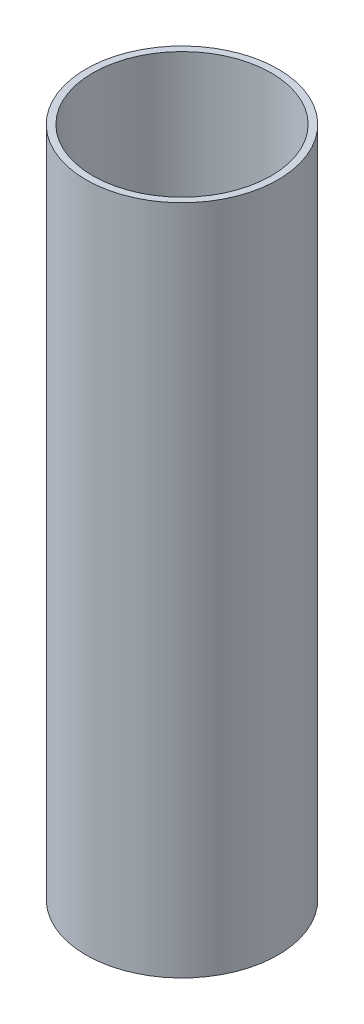
ISO-10303-21;
HEADER;
FILE_DESCRIPTION(('STEP AP214'),'2;1');
FILE_NAME('part.step','',(''),(''),'','','');
FILE_SCHEMA(('AUTOMOTIVE_DESIGN { 1 0 10303 214 1 1 1 1 }'));
ENDSEC;
DATA;
#1=APPLICATION_CONTEXT('core data for automotive mechanical design processes');
#2=APPLICATION_PROTOCOL_DEFINITION('international standard','automotive_design',2000,#1);
#3=PRODUCT_CONTEXT('',#1,'mechanical');
#4=PRODUCT('Part','Part','',(#3));
#5=PRODUCT_RELATED_PRODUCT_CATEGORY('part','',(#4));
#6=PRODUCT_DEFINITION_FORMATION('','',#4);
#7=PRODUCT_DEFINITION_CONTEXT('part definition',#1,'design');
#8=PRODUCT_DEFINITION('design','',#6,#7);
#9=PRODUCT_DEFINITION_SHAPE('','',#8);
#10=(LENGTH_UNIT() NAMED_UNIT(*) SI_UNIT(.MILLI.,.METRE.));
#11=(NAMED_UNIT(*) PLANE_ANGLE_UNIT() SI_UNIT($,.RADIAN.));
#12=(NAMED_UNIT(*) SI_UNIT($,.STERADIAN.) SOLID_ANGLE_UNIT());
#13=UNCERTAINTY_MEASURE_WITH_UNIT(LENGTH_MEASURE(1.E-05),#10,'distance_accuracy_value','');
#14=(GEOMETRIC_REPRESENTATION_CONTEXT(3) GLOBAL_UNCERTAINTY_ASSIGNED_CONTEXT((#13)) GLOBAL_UNIT_ASSIGNED_CONTEXT((#10,
#11,#12)) REPRESENTATION_CONTEXT('',''));
#15=CARTESIAN_POINT('',(0.,0.,0.));
#16=DIRECTION('',(0.,0.,1.));
#17=DIRECTION('',(1.,0.,0.));
#18=AXIS2_PLACEMENT_3D('',#15,#16,#17);
#19=CARTESIAN_POINT('',(0.,-13.97,0.));
#20=DIRECTION('',(0.,-1.,0.));
#21=DIRECTION('',(0.,0.,-1.));
#22=AXIS2_PLACEMENT_3D('',#19,#20,#21);
#23=CYLINDRICAL_SURFACE('',#22,23.622);
#24=CARTESIAN_POINT('',(0.,0.,0.));
#25=DIRECTION('',(0.,-1.,0.));
#26=DIRECTION('',(0.,0.,-1.));
#27=AXIS2_PLACEMENT_3D('',#24,#25,#26);
#28=CIRCLE('',#27,23.622);
#29=CARTESIAN_POINT('',(0.,0.,-23.622));
#30=VERTEX_POINT('',#29);
#31=EDGE_CURVE('E50',#30,#30,#28,.T.);
#32=ORIENTED_EDGE('',*,*,#31,.T.);
#33=EDGE_LOOP('',(#32));
#34=FACE_BOUND('',#33,.T.);
#35=CARTESIAN_POINT('',(0.,177.8,0.));
#36=DIRECTION('',(0.,-1.,0.));
#37=DIRECTION('',(0.,0.,-1.));
#38=AXIS2_PLACEMENT_3D('',#35,#36,#37);
#39=CIRCLE('',#38,23.622);
#40=CARTESIAN_POINT('',(0.,177.8,-23.622));
#41=VERTEX_POINT('',#40);
#42=EDGE_CURVE('E10',#41,#41,#39,.T.);
#43=ORIENTED_EDGE('',*,*,#42,.F.);
#44=EDGE_LOOP('',(#43));
#45=FACE_BOUND('',#44,.T.);
#46=ADVANCED_FACE('F36',(#34,#45),#23,.F.);
#47=CARTESIAN_POINT('',(23.622,177.8,0.));
#48=DIRECTION('',(0.,1.,0.));
#49=DIRECTION('',(0.,0.,1.));
#50=AXIS2_PLACEMENT_3D('',#47,#48,#49);
#51=PLANE('',#50);
#52=ORIENTED_EDGE('',*,*,#42,.T.);
#53=EDGE_LOOP('',(#52));
#54=FACE_BOUND('',#53,.T.);
#55=CARTESIAN_POINT('',(0.,177.8,0.));
#56=DIRECTION('',(0.,-1.,0.));
#57=DIRECTION('',(0.,0.,-1.));
#58=AXIS2_PLACEMENT_3D('',#55,#56,#57);
#59=CIRCLE('',#58,25.4254);
#60=CARTESIAN_POINT('',(0.,177.8,-25.4254));
#61=VERTEX_POINT('',#60);
#62=EDGE_CURVE('E42',#61,#61,#59,.T.);
#63=ORIENTED_EDGE('',*,*,#62,.F.);
#64=EDGE_LOOP('',(#63));
#65=FACE_BOUND('',#64,.T.);
#66=ADVANCED_FACE('F66',(#54,#65),#51,.T.);
#67=CARTESIAN_POINT('',(0.,-13.97,0.));
#68=DIRECTION('',(0.,-1.,0.));
#69=DIRECTION('',(0.,0.,-1.));
#70=AXIS2_PLACEMENT_3D('',#67,#68,#69);
#71=CYLINDRICAL_SURFACE('',#70,25.4254);
#72=ORIENTED_EDGE('',*,*,#62,.T.);
#73=EDGE_LOOP('',(#72));
#74=FACE_BOUND('',#73,.T.);
#75=CARTESIAN_POINT('',(0.,0.,0.));
#76=DIRECTION('',(0.,-1.,0.));
#77=DIRECTION('',(0.,0.,-1.));
#78=AXIS2_PLACEMENT_3D('',#75,#76,#77);
#79=CIRCLE('',#78,25.4254);
#80=CARTESIAN_POINT('',(0.,0.,-25.4254));
#81=VERTEX_POINT('',#80);
#82=EDGE_CURVE('E46',#81,#81,#79,.T.);
#83=ORIENTED_EDGE('',*,*,#82,.F.);
#84=EDGE_LOOP('',(#83));
#85=FACE_BOUND('',#84,.T.);
#86=ADVANCED_FACE('F60',(#74,#85),#71,.T.);
#87=CARTESIAN_POINT('',(23.622,0.,0.));
#88=DIRECTION('',(0.,-1.,0.));
#89=DIRECTION('',(0.,0.,-1.));
#90=AXIS2_PLACEMENT_3D('',#87,#88,#89);
#91=PLANE('',#90);
#92=ORIENTED_EDGE('',*,*,#82,.T.);
#93=EDGE_LOOP('',(#92));
#94=FACE_BOUND('',#93,.T.);
#95=ORIENTED_EDGE('',*,*,#31,.F.);
#96=EDGE_LOOP('',(#95));
#97=FACE_BOUND('',#96,.T.);
#98=ADVANCED_FACE('F58',(#94,#97),#91,.T.);
#99=CLOSED_SHELL('',(#46,#66,#86,#98));
#100=MANIFOLD_SOLID_BREP('B2',#99);
#101=ADVANCED_BREP_SHAPE_REPRESENTATION('',(#18,#100),#14);
#102=SHAPE_DEFINITION_REPRESENTATION(#9,#101);
ENDSEC;
END-ISO-10303-21;
